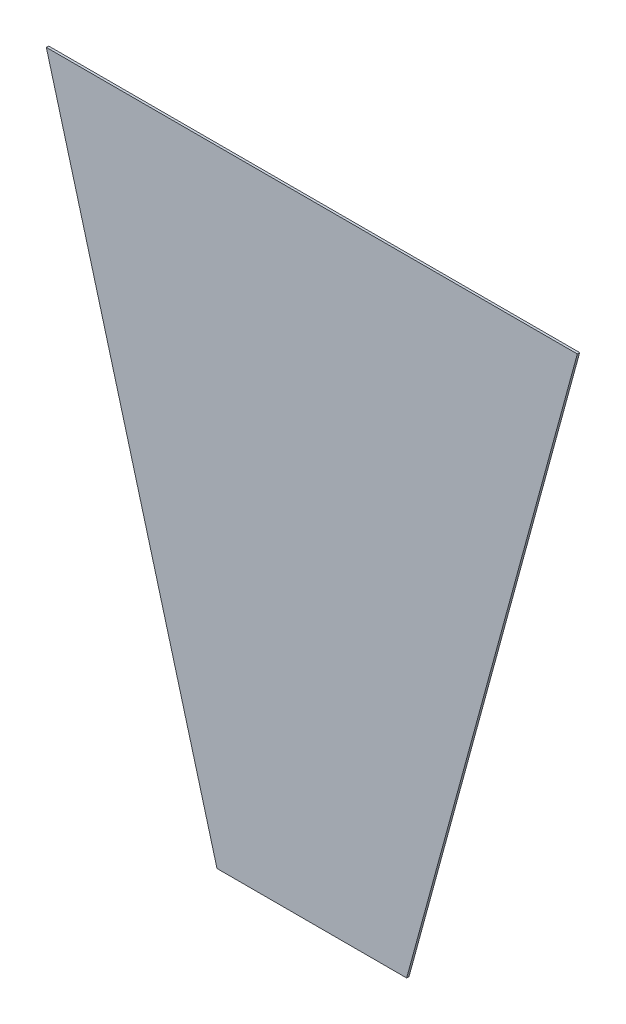
ISO-10303-21;
HEADER;
FILE_DESCRIPTION(('STEP AP214'),'2;1');
FILE_NAME('part.step','',(''),(''),'','','');
FILE_SCHEMA(('AUTOMOTIVE_DESIGN { 1 0 10303 214 1 1 1 1 }'));
ENDSEC;
DATA;
#1=APPLICATION_CONTEXT('core data for automotive mechanical design processes');
#2=APPLICATION_PROTOCOL_DEFINITION('international standard','automotive_design',2000,#1);
#3=PRODUCT_CONTEXT('',#1,'mechanical');
#4=PRODUCT('Part','Part','',(#3));
#5=PRODUCT_RELATED_PRODUCT_CATEGORY('part','',(#4));
#6=PRODUCT_DEFINITION_FORMATION('','',#4);
#7=PRODUCT_DEFINITION_CONTEXT('part definition',#1,'design');
#8=PRODUCT_DEFINITION('design','',#6,#7);
#9=PRODUCT_DEFINITION_SHAPE('','',#8);
#10=(LENGTH_UNIT() NAMED_UNIT(*) SI_UNIT(.MILLI.,.METRE.));
#11=(NAMED_UNIT(*) PLANE_ANGLE_UNIT() SI_UNIT($,.RADIAN.));
#12=(NAMED_UNIT(*) SI_UNIT($,.STERADIAN.) SOLID_ANGLE_UNIT());
#13=UNCERTAINTY_MEASURE_WITH_UNIT(LENGTH_MEASURE(1.E-05),#10,'distance_accuracy_value','');
#14=(GEOMETRIC_REPRESENTATION_CONTEXT(3) GLOBAL_UNCERTAINTY_ASSIGNED_CONTEXT((#13)) GLOBAL_UNIT_ASSIGNED_CONTEXT((#10,
#11,#12)) REPRESENTATION_CONTEXT('',''));
#15=CARTESIAN_POINT('',(0.,0.,0.));
#16=DIRECTION('',(0.,0.,1.));
#17=DIRECTION('',(1.,0.,0.));
#18=AXIS2_PLACEMENT_3D('',#15,#16,#17);
#19=CARTESIAN_POINT('',(177.8,419.1,0.));
#20=DIRECTION('',(0.964763821237732,-0.263117405792109,0.));
#21=DIRECTION('',(0.263117405792109,0.964763821237732,0.));
#22=AXIS2_PLACEMENT_3D('',#19,#20,#21);
#23=PLANE('',#22);
#24=DIRECTION('',(-0.263117405792109,-0.964763821237732,0.));
#25=VECTOR('',#24,1.);
#26=CARTESIAN_POINT('',(177.8,419.1,1.5875));
#27=LINE('',#26,#25);
#28=CARTESIAN_POINT('',(177.8,419.1,1.5875));
#29=VERTEX_POINT('',#28);
#30=CARTESIAN_POINT('',(63.5,0.,1.5875));
#31=VERTEX_POINT('',#30);
#32=EDGE_CURVE('E9',#29,#31,#27,.T.);
#33=ORIENTED_EDGE('',*,*,#32,.T.);
#34=DIRECTION('',(0.,0.,1.));
#35=VECTOR('',#34,1.);
#36=CARTESIAN_POINT('',(63.5,0.,0.));
#37=LINE('',#36,#35);
#38=CARTESIAN_POINT('',(63.5,0.,0.));
#39=VERTEX_POINT('',#38);
#40=EDGE_CURVE('E34',#39,#31,#37,.T.);
#41=ORIENTED_EDGE('',*,*,#40,.F.);
#42=DIRECTION('',(-0.263117405792109,-0.964763821237732,0.));
#43=VECTOR('',#42,1.);
#44=CARTESIAN_POINT('',(177.8,419.1,0.));
#45=LINE('',#44,#43);
#46=CARTESIAN_POINT('',(177.8,419.1,0.));
#47=VERTEX_POINT('',#46);
#48=EDGE_CURVE('E74',#47,#39,#45,.T.);
#49=ORIENTED_EDGE('',*,*,#48,.F.);
#50=DIRECTION('',(0.,0.,1.));
#51=VECTOR('',#50,1.);
#52=CARTESIAN_POINT('',(177.8,419.1,0.));
#53=LINE('',#52,#51);
#54=EDGE_CURVE('E25',#47,#29,#53,.T.);
#55=ORIENTED_EDGE('',*,*,#54,.T.);
#56=EDGE_LOOP('',(#33,#41,#49,#55));
#57=FACE_BOUND('',#56,.T.);
#58=ADVANCED_FACE('F15',(#57),#23,.T.);
#59=CARTESIAN_POINT('',(63.5,0.,0.));
#60=DIRECTION('',(0.,-1.,0.));
#61=DIRECTION('',(1.,0.,0.));
#62=AXIS2_PLACEMENT_3D('',#59,#60,#61);
#63=PLANE('',#62);
#64=DIRECTION('',(-1.,0.,0.));
#65=VECTOR('',#64,1.);
#66=CARTESIAN_POINT('',(63.5,0.,1.5875));
#67=LINE('',#66,#65);
#68=CARTESIAN_POINT('',(-63.5,0.,1.5875));
#69=VERTEX_POINT('',#68);
#70=EDGE_CURVE('E80',#31,#69,#67,.T.);
#71=ORIENTED_EDGE('',*,*,#70,.T.);
#72=DIRECTION('',(0.,0.,1.));
#73=VECTOR('',#72,1.);
#74=CARTESIAN_POINT('',(-63.5,0.,0.));
#75=LINE('',#74,#73);
#76=CARTESIAN_POINT('',(-63.5,0.,0.));
#77=VERTEX_POINT('',#76);
#78=EDGE_CURVE('E82',#77,#69,#75,.T.);
#79=ORIENTED_EDGE('',*,*,#78,.F.);
#80=DIRECTION('',(-1.,0.,0.));
#81=VECTOR('',#80,1.);
#82=CARTESIAN_POINT('',(63.5,0.,0.));
#83=LINE('',#82,#81);
#84=EDGE_CURVE('E61',#39,#77,#83,.T.);
#85=ORIENTED_EDGE('',*,*,#84,.F.);
#86=ORIENTED_EDGE('',*,*,#40,.T.);
#87=EDGE_LOOP('',(#71,#79,#85,#86));
#88=FACE_BOUND('',#87,.T.);
#89=ADVANCED_FACE('F89',(#88),#63,.T.);
#90=CARTESIAN_POINT('',(-63.5,0.,0.));
#91=DIRECTION('',(-0.964763821237732,-0.263117405792109,0.));
#92=DIRECTION('',(0.263117405792109,-0.964763821237732,0.));
#93=AXIS2_PLACEMENT_3D('',#90,#91,#92);
#94=PLANE('',#93);
#95=DIRECTION('',(-0.263117405792109,0.964763821237732,0.));
#96=VECTOR('',#95,1.);
#97=CARTESIAN_POINT('',(-63.5,0.,1.5875));
#98=LINE('',#97,#96);
#99=CARTESIAN_POINT('',(-177.8,419.1,1.5875));
#100=VERTEX_POINT('',#99);
#101=EDGE_CURVE('E67',#69,#100,#98,.T.);
#102=ORIENTED_EDGE('',*,*,#101,.T.);
#103=DIRECTION('',(0.,0.,1.));
#104=VECTOR('',#103,1.);
#105=CARTESIAN_POINT('',(-177.8,419.1,0.));
#106=LINE('',#105,#104);
#107=CARTESIAN_POINT('',(-177.8,419.1,0.));
#108=VERTEX_POINT('',#107);
#109=EDGE_CURVE('E54',#108,#100,#106,.T.);
#110=ORIENTED_EDGE('',*,*,#109,.F.);
#111=DIRECTION('',(-0.263117405792109,0.964763821237732,0.));
#112=VECTOR('',#111,1.);
#113=CARTESIAN_POINT('',(-63.5,0.,0.));
#114=LINE('',#113,#112);
#115=EDGE_CURVE('E60',#77,#108,#114,.T.);
#116=ORIENTED_EDGE('',*,*,#115,.F.);
#117=ORIENTED_EDGE('',*,*,#78,.T.);
#118=EDGE_LOOP('',(#102,#110,#116,#117));
#119=FACE_BOUND('',#118,.T.);
#120=ADVANCED_FACE('F65',(#119),#94,.T.);
#121=CARTESIAN_POINT('',(-177.8,419.1,0.));
#122=DIRECTION('',(0.,1.,0.));
#123=DIRECTION('',(0.,0.,1.));
#124=AXIS2_PLACEMENT_3D('',#121,#122,#123);
#125=PLANE('',#124);
#126=DIRECTION('',(1.,0.,0.));
#127=VECTOR('',#126,1.);
#128=CARTESIAN_POINT('',(-177.8,419.1,1.5875));
#129=LINE('',#128,#127);
#130=EDGE_CURVE('E69',#100,#29,#129,.T.);
#131=ORIENTED_EDGE('',*,*,#130,.T.);
#132=ORIENTED_EDGE('',*,*,#54,.F.);
#133=DIRECTION('',(1.,0.,0.));
#134=VECTOR('',#133,1.);
#135=CARTESIAN_POINT('',(-177.8,419.1,0.));
#136=LINE('',#135,#134);
#137=EDGE_CURVE('E19',#108,#47,#136,.T.);
#138=ORIENTED_EDGE('',*,*,#137,.F.);
#139=ORIENTED_EDGE('',*,*,#109,.T.);
#140=EDGE_LOOP('',(#131,#132,#138,#139));
#141=FACE_BOUND('',#140,.T.);
#142=ADVANCED_FACE('F72',(#141),#125,.T.);
#143=CARTESIAN_POINT('',(0.,244.996681444959,1.5875));
#144=DIRECTION('',(0.,0.,1.));
#145=DIRECTION('',(1.,0.,0.));
#146=AXIS2_PLACEMENT_3D('',#143,#144,#145);
#147=PLANE('',#146);
#148=ORIENTED_EDGE('',*,*,#32,.F.);
#149=ORIENTED_EDGE('',*,*,#130,.F.);
#150=ORIENTED_EDGE('',*,*,#101,.F.);
#151=ORIENTED_EDGE('',*,*,#70,.F.);
#152=EDGE_LOOP('',(#148,#149,#150,#151));
#153=FACE_BOUND('',#152,.T.);
#154=ADVANCED_FACE('F86',(#153),#147,.T.);
#155=CARTESIAN_POINT('',(0.,244.996681444959,0.));
#156=DIRECTION('',(0.,0.,1.));
#157=DIRECTION('',(1.,0.,0.));
#158=AXIS2_PLACEMENT_3D('',#155,#156,#157);
#159=PLANE('',#158);
#160=ORIENTED_EDGE('',*,*,#137,.T.);
#161=ORIENTED_EDGE('',*,*,#48,.T.);
#162=ORIENTED_EDGE('',*,*,#84,.T.);
#163=ORIENTED_EDGE('',*,*,#115,.T.);
#164=EDGE_LOOP('',(#160,#161,#162,#163));
#165=FACE_BOUND('',#164,.T.);
#166=ADVANCED_FACE('F17',(#165),#159,.F.);
#167=CLOSED_SHELL('',(#58,#89,#120,#142,#154,#166));
#168=MANIFOLD_SOLID_BREP('B1',#167);
#169=ADVANCED_BREP_SHAPE_REPRESENTATION('',(#18,#168),#14);
#170=SHAPE_DEFINITION_REPRESENTATION(#9,#169);
ENDSEC;
END-ISO-10303-21;
